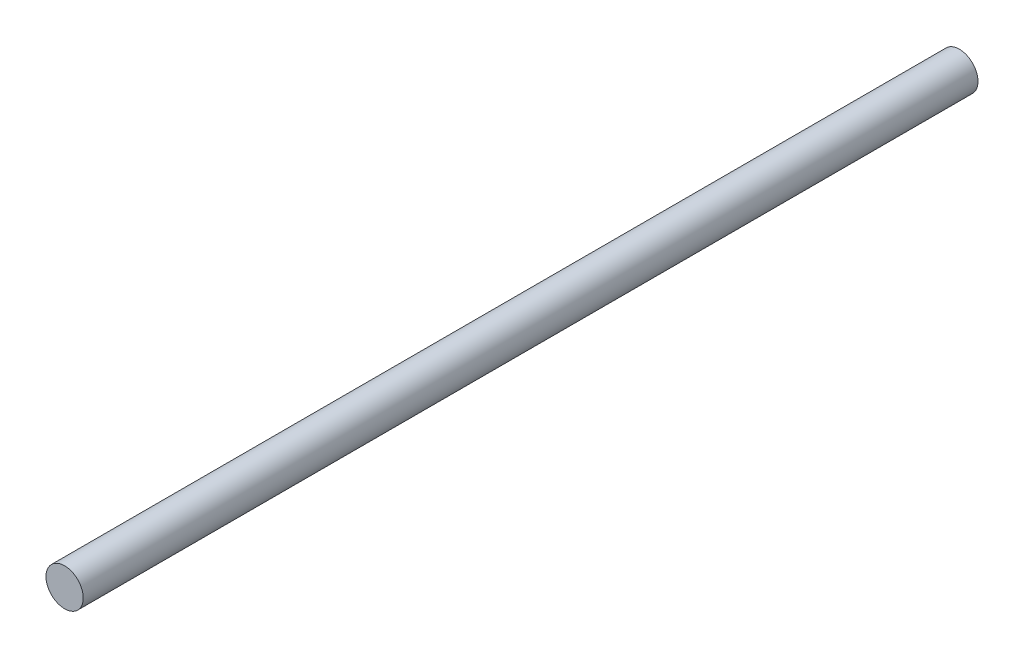
ISO-10303-21;
HEADER;
FILE_DESCRIPTION(('STEP AP214'),'2;1');
FILE_NAME('part.step','',(''),(''),'','','');
FILE_SCHEMA(('AUTOMOTIVE_DESIGN { 1 0 10303 214 1 1 1 1 }'));
ENDSEC;
DATA;
#1=APPLICATION_CONTEXT('core data for automotive mechanical design processes');
#2=APPLICATION_PROTOCOL_DEFINITION('international standard','automotive_design',2000,#1);
#3=PRODUCT_CONTEXT('',#1,'mechanical');
#4=PRODUCT('Part','Part','',(#3));
#5=PRODUCT_RELATED_PRODUCT_CATEGORY('part','',(#4));
#6=PRODUCT_DEFINITION_FORMATION('','',#4);
#7=PRODUCT_DEFINITION_CONTEXT('part definition',#1,'design');
#8=PRODUCT_DEFINITION('design','',#6,#7);
#9=PRODUCT_DEFINITION_SHAPE('','',#8);
#10=(LENGTH_UNIT() NAMED_UNIT(*) SI_UNIT(.MILLI.,.METRE.));
#11=(NAMED_UNIT(*) PLANE_ANGLE_UNIT() SI_UNIT($,.RADIAN.));
#12=(NAMED_UNIT(*) SI_UNIT($,.STERADIAN.) SOLID_ANGLE_UNIT());
#13=UNCERTAINTY_MEASURE_WITH_UNIT(LENGTH_MEASURE(1.E-05),#10,'distance_accuracy_value','');
#14=(GEOMETRIC_REPRESENTATION_CONTEXT(3) GLOBAL_UNCERTAINTY_ASSIGNED_CONTEXT((#13)) GLOBAL_UNIT_ASSIGNED_CONTEXT((#10,
#11,#12)) REPRESENTATION_CONTEXT('',''));
#15=CARTESIAN_POINT('',(0.,0.,0.));
#16=DIRECTION('',(0.,0.,1.));
#17=DIRECTION('',(1.,0.,0.));
#18=AXIS2_PLACEMENT_3D('',#15,#16,#17);
#19=CARTESIAN_POINT('',(0.,0.,120.));
#20=DIRECTION('',(0.,0.,-1.));
#21=DIRECTION('',(-1.,0.,0.));
#22=AXIS2_PLACEMENT_3D('',#19,#20,#21);
#23=CYLINDRICAL_SURFACE('',#22,2.5);
#24=CARTESIAN_POINT('',(0.,0.,120.));
#25=DIRECTION('',(0.,0.,1.));
#26=DIRECTION('',(1.,0.,0.));
#27=AXIS2_PLACEMENT_3D('',#24,#25,#26);
#28=CIRCLE('',#27,2.5);
#29=CARTESIAN_POINT('',(2.5,0.,120.));
#30=VERTEX_POINT('',#29);
#31=EDGE_CURVE('E10',#30,#30,#28,.T.);
#32=ORIENTED_EDGE('',*,*,#31,.F.);
#33=EDGE_LOOP('',(#32));
#34=FACE_BOUND('',#33,.T.);
#35=CARTESIAN_POINT('',(0.,0.,0.));
#36=DIRECTION('',(0.,0.,1.));
#37=DIRECTION('',(1.,0.,0.));
#38=AXIS2_PLACEMENT_3D('',#35,#36,#37);
#39=CIRCLE('',#38,2.5);
#40=CARTESIAN_POINT('',(2.5,0.,0.));
#41=VERTEX_POINT('',#40);
#42=EDGE_CURVE('E44',#41,#41,#39,.T.);
#43=ORIENTED_EDGE('',*,*,#42,.T.);
#44=EDGE_LOOP('',(#43));
#45=FACE_BOUND('',#44,.T.);
#46=ADVANCED_FACE('F41',(#34,#45),#23,.T.);
#47=CARTESIAN_POINT('',(0.,0.,120.));
#48=DIRECTION('',(0.,0.,1.));
#49=DIRECTION('',(1.,0.,0.));
#50=AXIS2_PLACEMENT_3D('',#47,#48,#49);
#51=PLANE('',#50);
#52=ORIENTED_EDGE('',*,*,#31,.T.);
#53=EDGE_LOOP('',(#52));
#54=FACE_BOUND('',#53,.T.);
#55=ADVANCED_FACE('F58',(#54),#51,.T.);
#56=CARTESIAN_POINT('',(0.,0.,0.));
#57=DIRECTION('',(0.,0.,1.));
#58=DIRECTION('',(1.,0.,0.));
#59=AXIS2_PLACEMENT_3D('',#56,#57,#58);
#60=PLANE('',#59);
#61=ORIENTED_EDGE('',*,*,#42,.F.);
#62=EDGE_LOOP('',(#61));
#63=FACE_BOUND('',#62,.T.);
#64=ADVANCED_FACE('F56',(#63),#60,.F.);
#65=CLOSED_SHELL('',(#46,#55,#64));
#66=MANIFOLD_SOLID_BREP('B2',#65);
#67=ADVANCED_BREP_SHAPE_REPRESENTATION('',(#18,#66),#14);
#68=SHAPE_DEFINITION_REPRESENTATION(#9,#67);
ENDSEC;
END-ISO-10303-21;
